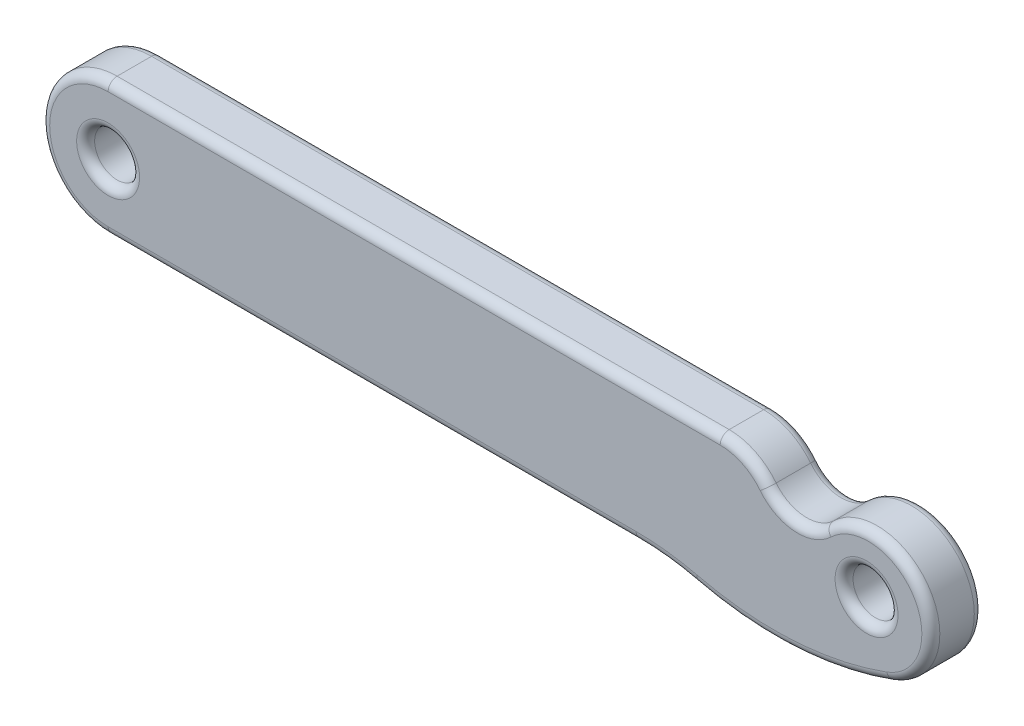
ISO-10303-21;
HEADER;
FILE_DESCRIPTION(('STEP AP214'),'2;1');
FILE_NAME('part.step','',(''),(''),'','','');
FILE_SCHEMA(('AUTOMOTIVE_DESIGN { 1 0 10303 214 1 1 1 1 }'));
ENDSEC;
DATA;
#1=APPLICATION_CONTEXT('core data for automotive mechanical design processes');
#2=APPLICATION_PROTOCOL_DEFINITION('international standard','automotive_design',2000,#1);
#3=PRODUCT_CONTEXT('',#1,'mechanical');
#4=PRODUCT('Part','Part','',(#3));
#5=PRODUCT_RELATED_PRODUCT_CATEGORY('part','',(#4));
#6=PRODUCT_DEFINITION_FORMATION('','',#4);
#7=PRODUCT_DEFINITION_CONTEXT('part definition',#1,'design');
#8=PRODUCT_DEFINITION('design','',#6,#7);
#9=PRODUCT_DEFINITION_SHAPE('','',#8);
#10=(LENGTH_UNIT() NAMED_UNIT(*) SI_UNIT(.MILLI.,.METRE.));
#11=(NAMED_UNIT(*) PLANE_ANGLE_UNIT() SI_UNIT($,.RADIAN.));
#12=(NAMED_UNIT(*) SI_UNIT($,.STERADIAN.) SOLID_ANGLE_UNIT());
#13=UNCERTAINTY_MEASURE_WITH_UNIT(LENGTH_MEASURE(1.E-05),#10,'distance_accuracy_value','');
#14=(GEOMETRIC_REPRESENTATION_CONTEXT(3) GLOBAL_UNCERTAINTY_ASSIGNED_CONTEXT((#13)) GLOBAL_UNIT_ASSIGNED_CONTEXT((#10,
#11,#12)) REPRESENTATION_CONTEXT('',''));
#15=CARTESIAN_POINT('',(0.,0.,0.));
#16=DIRECTION('',(0.,0.,1.));
#17=DIRECTION('',(1.,0.,0.));
#18=AXIS2_PLACEMENT_3D('',#15,#16,#17);
#19=CARTESIAN_POINT('',(0.,0.,1.75));
#20=DIRECTION('',(0.,0.,1.));
#21=DIRECTION('',(1.,0.,0.));
#22=AXIS2_PLACEMENT_3D('',#19,#20,#21);
#23=PLANE('',#22);
#24=CARTESIAN_POINT('',(25.3139123,0.,1.75));
#25=DIRECTION('',(0.,0.,1.));
#26=DIRECTION('',(1.,0.,0.));
#27=AXIS2_PLACEMENT_3D('',#24,#25,#26);
#28=CIRCLE('',#27,1.05);
#29=CARTESIAN_POINT('',(26.3639123,0.,1.75));
#30=VERTEX_POINT('',#29);
#31=EDGE_CURVE('E13',#30,#30,#28,.F.);
#32=ORIENTED_EDGE('',*,*,#31,.T.);
#33=EDGE_LOOP('',(#32));
#34=FACE_BOUND('',#33,.T.);
#35=CARTESIAN_POINT('',(0.,0.,1.75));
#36=DIRECTION('',(0.,0.,1.));
#37=DIRECTION('',(1.,0.,0.));
#38=AXIS2_PLACEMENT_3D('',#35,#36,#37);
#39=CIRCLE('',#38,1.05);
#40=CARTESIAN_POINT('',(1.05,0.,1.75));
#41=VERTEX_POINT('',#40);
#42=EDGE_CURVE('E55',#41,#41,#39,.F.);
#43=ORIENTED_EDGE('',*,*,#42,.T.);
#44=EDGE_LOOP('',(#43));
#45=FACE_BOUND('',#44,.T.);
#46=DIRECTION('',(-1.,0.,0.));
#47=VECTOR('',#46,1.);
#48=CARTESIAN_POINT('',(0.,1.95,1.75));
#49=LINE('',#48,#47);
#50=CARTESIAN_POINT('',(20.428705221818,1.95,1.75));
#51=VERTEX_POINT('',#50);
#52=CARTESIAN_POINT('',(0.,1.95,1.75));
#53=VERTEX_POINT('',#52);
#54=EDGE_CURVE('E63',#51,#53,#49,.T.);
#55=ORIENTED_EDGE('',*,*,#54,.T.);
#56=CARTESIAN_POINT('',(0.,0.,1.75));
#57=DIRECTION('',(0.,0.,1.));
#58=DIRECTION('',(1.,0.,0.));
#59=AXIS2_PLACEMENT_3D('',#56,#57,#58);
#60=CIRCLE('',#59,1.95);
#61=CARTESIAN_POINT('',(0.,-1.95,1.75));
#62=VERTEX_POINT('',#61);
#63=EDGE_CURVE('E254',#53,#62,#60,.T.);
#64=ORIENTED_EDGE('',*,*,#63,.T.);
#65=DIRECTION('',(1.,0.,0.));
#66=VECTOR('',#65,1.);
#67=CARTESIAN_POINT('',(17.6231832897015,-1.95,1.75));
#68=LINE('',#67,#66);
#69=CARTESIAN_POINT('',(17.6231832897015,-1.95,1.75));
#70=VERTEX_POINT('',#69);
#71=EDGE_CURVE('E242',#62,#70,#68,.T.);
#72=ORIENTED_EDGE('',*,*,#71,.T.);
#73=CARTESIAN_POINT('',(17.6231832897015,-10.658025818146,1.75));
#74=DIRECTION('',(0.,0.,1.));
#75=DIRECTION('',(1.,0.,0.));
#76=AXIS2_PLACEMENT_3D('',#73,#74,#75);
#77=CIRCLE('',#76,8.70802581814601);
#78=CARTESIAN_POINT('',(19.6652217516383,-2.19281509605124,1.75));
#79=VERTEX_POINT('',#78);
#80=EDGE_CURVE('E244',#70,#79,#77,.F.);
#81=ORIENTED_EDGE('',*,*,#80,.T.);
#82=CARTESIAN_POINT('',(22.2272317743348,8.42792252398077,1.75));
#83=DIRECTION('',(0.,0.,1.));
#84=DIRECTION('',(1.,0.,0.));
#85=AXIS2_PLACEMENT_3D('',#82,#83,#84);
#86=CIRCLE('',#85,10.9253815928763);
#87=CARTESIAN_POINT('',(25.9845274669165,-1.83105851842629,1.75));
#88=VERTEX_POINT('',#87);
#89=EDGE_CURVE('E246',#79,#88,#86,.T.);
#90=ORIENTED_EDGE('',*,*,#89,.T.);
#91=CARTESIAN_POINT('',(25.3684003786519,-0.148775132878208,1.75));
#92=DIRECTION('',(0.,0.,1.));
#93=DIRECTION('',(1.,0.,0.));
#94=AXIS2_PLACEMENT_3D('',#91,#92,#93);
#95=CIRCLE('',#94,1.79156076597604);
#96=CARTESIAN_POINT('',(24.1267235404538,1.14270797102491,1.75));
#97=VERTEX_POINT('',#96);
#98=EDGE_CURVE('E248',#88,#97,#95,.T.);
#99=ORIENTED_EDGE('',*,*,#98,.T.);
#100=CARTESIAN_POINT('',(23.0178117028837,2.29610059129665,1.75));
#101=DIRECTION('',(0.,0.,1.));
#102=DIRECTION('',(1.,0.,0.));
#103=AXIS2_PLACEMENT_3D('',#100,#101,#102);
#104=CIRCLE('',#103,1.60000000000013);
#105=CARTESIAN_POINT('',(21.7624873484276,1.30405181975884,1.75));
#106=VERTEX_POINT('',#105);
#107=EDGE_CURVE('E250',#97,#106,#104,.F.);
#108=ORIENTED_EDGE('',*,*,#107,.T.);
#109=CARTESIAN_POINT('',(20.428705221818,0.25,1.75));
#110=DIRECTION('',(0.,0.,1.));
#111=DIRECTION('',(1.,0.,0.));
#112=AXIS2_PLACEMENT_3D('',#109,#110,#111);
#113=CIRCLE('',#112,1.7);
#114=EDGE_CURVE('E68',#106,#51,#113,.T.);
#115=ORIENTED_EDGE('',*,*,#114,.T.);
#116=EDGE_LOOP('',(#55,#64,#72,#81,#90,#99,#108,#115));
#117=FACE_BOUND('',#116,.T.);
#118=ADVANCED_FACE('F46',(#34,#45,#117),#23,.T.);
#119=CARTESIAN_POINT('',(0.,0.,0.));
#120=DIRECTION('',(0.,0.,1.));
#121=DIRECTION('',(1.,0.,0.));
#122=AXIS2_PLACEMENT_3D('',#119,#120,#121);
#123=PLANE('',#122);
#124=CARTESIAN_POINT('',(25.3139123,0.,0.));
#125=DIRECTION('',(0.,0.,1.));
#126=DIRECTION('',(1.,0.,0.));
#127=AXIS2_PLACEMENT_3D('',#124,#125,#126);
#128=CIRCLE('',#127,1.05);
#129=CARTESIAN_POINT('',(26.3639123,0.,0.));
#130=VERTEX_POINT('',#129);
#131=EDGE_CURVE('E190',#130,#130,#128,.T.);
#132=ORIENTED_EDGE('',*,*,#131,.T.);
#133=EDGE_LOOP('',(#132));
#134=FACE_BOUND('',#133,.T.);
#135=CARTESIAN_POINT('',(0.,0.,0.));
#136=DIRECTION('',(0.,0.,1.));
#137=DIRECTION('',(1.,0.,0.));
#138=AXIS2_PLACEMENT_3D('',#135,#136,#137);
#139=CIRCLE('',#138,1.05);
#140=CARTESIAN_POINT('',(1.05,0.,0.));
#141=VERTEX_POINT('',#140);
#142=EDGE_CURVE('E187',#141,#141,#139,.T.);
#143=ORIENTED_EDGE('',*,*,#142,.T.);
#144=EDGE_LOOP('',(#143));
#145=FACE_BOUND('',#144,.T.);
#146=CARTESIAN_POINT('',(20.428705221818,0.25,0.));
#147=DIRECTION('',(0.,0.,1.));
#148=DIRECTION('',(1.,0.,0.));
#149=AXIS2_PLACEMENT_3D('',#146,#147,#148);
#150=CIRCLE('',#149,1.7);
#151=CARTESIAN_POINT('',(20.428705221818,1.95,0.));
#152=VERTEX_POINT('',#151);
#153=CARTESIAN_POINT('',(21.7624873484276,1.30405181975884,0.));
#154=VERTEX_POINT('',#153);
#155=EDGE_CURVE('E185',#152,#154,#150,.F.);
#156=ORIENTED_EDGE('',*,*,#155,.T.);
#157=CARTESIAN_POINT('',(23.0178117028837,2.29610059129665,0.));
#158=DIRECTION('',(0.,0.,1.));
#159=DIRECTION('',(1.,0.,0.));
#160=AXIS2_PLACEMENT_3D('',#157,#158,#159);
#161=CIRCLE('',#160,1.60000000000013);
#162=CARTESIAN_POINT('',(24.1267235404538,1.14270797102491,0.));
#163=VERTEX_POINT('',#162);
#164=EDGE_CURVE('E166',#154,#163,#161,.T.);
#165=ORIENTED_EDGE('',*,*,#164,.T.);
#166=CARTESIAN_POINT('',(25.3684003786519,-0.148775132878208,0.));
#167=DIRECTION('',(0.,0.,1.));
#168=DIRECTION('',(1.,0.,0.));
#169=AXIS2_PLACEMENT_3D('',#166,#167,#168);
#170=CIRCLE('',#169,1.79156076597604);
#171=CARTESIAN_POINT('',(25.9845274669165,-1.8310585184263,0.));
#172=VERTEX_POINT('',#171);
#173=EDGE_CURVE('E174',#163,#172,#170,.F.);
#174=ORIENTED_EDGE('',*,*,#173,.T.);
#175=CARTESIAN_POINT('',(22.2272317743348,8.42792252398077,0.));
#176=DIRECTION('',(0.,0.,1.));
#177=DIRECTION('',(1.,0.,0.));
#178=AXIS2_PLACEMENT_3D('',#175,#176,#177);
#179=CIRCLE('',#178,10.9253815928763);
#180=CARTESIAN_POINT('',(19.6652217516383,-2.19281509605124,0.));
#181=VERTEX_POINT('',#180);
#182=EDGE_CURVE('E180',#172,#181,#179,.F.);
#183=ORIENTED_EDGE('',*,*,#182,.T.);
#184=CARTESIAN_POINT('',(17.6231832897015,-10.658025818146,0.));
#185=DIRECTION('',(0.,0.,1.));
#186=DIRECTION('',(1.,0.,0.));
#187=AXIS2_PLACEMENT_3D('',#184,#185,#186);
#188=CIRCLE('',#187,8.70802581814601);
#189=CARTESIAN_POINT('',(17.6231832897015,-1.95,0.));
#190=VERTEX_POINT('',#189);
#191=EDGE_CURVE('E338',#181,#190,#188,.T.);
#192=ORIENTED_EDGE('',*,*,#191,.T.);
#193=DIRECTION('',(1.,0.,0.));
#194=VECTOR('',#193,1.);
#195=CARTESIAN_POINT('',(0.,-1.95,0.));
#196=LINE('',#195,#194);
#197=CARTESIAN_POINT('',(0.,-1.95,0.));
#198=VERTEX_POINT('',#197);
#199=EDGE_CURVE('E340',#190,#198,#196,.F.);
#200=ORIENTED_EDGE('',*,*,#199,.T.);
#201=CARTESIAN_POINT('',(0.,0.,0.));
#202=DIRECTION('',(0.,0.,1.));
#203=DIRECTION('',(1.,0.,0.));
#204=AXIS2_PLACEMENT_3D('',#201,#202,#203);
#205=CIRCLE('',#204,1.95);
#206=CARTESIAN_POINT('',(0.,1.95,0.));
#207=VERTEX_POINT('',#206);
#208=EDGE_CURVE('E342',#198,#207,#205,.F.);
#209=ORIENTED_EDGE('',*,*,#208,.T.);
#210=DIRECTION('',(-1.,0.,0.));
#211=VECTOR('',#210,1.);
#212=CARTESIAN_POINT('',(0.,1.95,0.));
#213=LINE('',#212,#211);
#214=EDGE_CURVE('E192',#207,#152,#213,.F.);
#215=ORIENTED_EDGE('',*,*,#214,.T.);
#216=EDGE_LOOP('',(#156,#165,#174,#183,#192,#200,#209,#215));
#217=FACE_BOUND('',#216,.T.);
#218=ADVANCED_FACE('F183',(#134,#145,#217),#123,.F.);
#219=CARTESIAN_POINT('',(0.,0.,1.75));
#220=DIRECTION('',(0.,0.,-1.));
#221=DIRECTION('',(-1.,0.,0.));
#222=AXIS2_PLACEMENT_3D('',#219,#220,#221);
#223=CYLINDRICAL_SURFACE('',#222,2.25);
#224=DIRECTION('',(0.,0.,-1.));
#225=VECTOR('',#224,1.);
#226=CARTESIAN_POINT('',(0.,2.25,1.75));
#227=LINE('',#226,#225);
#228=CARTESIAN_POINT('',(0.,2.25,1.45));
#229=VERTEX_POINT('',#228);
#230=CARTESIAN_POINT('',(0.,2.25,0.3));
#231=VERTEX_POINT('',#230);
#232=EDGE_CURVE('E320',#229,#231,#227,.T.);
#233=ORIENTED_EDGE('',*,*,#232,.T.);
#234=CARTESIAN_POINT('',(0.,0.,0.3));
#235=DIRECTION('',(0.,0.,1.));
#236=DIRECTION('',(1.,0.,0.));
#237=AXIS2_PLACEMENT_3D('',#234,#235,#236);
#238=CIRCLE('',#237,2.25);
#239=CARTESIAN_POINT('',(0.,-2.25,0.3));
#240=VERTEX_POINT('',#239);
#241=EDGE_CURVE('E224',#231,#240,#238,.T.);
#242=ORIENTED_EDGE('',*,*,#241,.T.);
#243=DIRECTION('',(0.,0.,-1.));
#244=VECTOR('',#243,1.);
#245=CARTESIAN_POINT('',(0.,-2.25,1.75));
#246=LINE('',#245,#244);
#247=CARTESIAN_POINT('',(0.,-2.25,1.45));
#248=VERTEX_POINT('',#247);
#249=EDGE_CURVE('E181',#248,#240,#246,.T.);
#250=ORIENTED_EDGE('',*,*,#249,.F.);
#251=CARTESIAN_POINT('',(0.,0.,1.45));
#252=DIRECTION('',(0.,0.,1.));
#253=DIRECTION('',(1.,0.,0.));
#254=AXIS2_PLACEMENT_3D('',#251,#252,#253);
#255=CIRCLE('',#254,2.25);
#256=EDGE_CURVE('E221',#248,#229,#255,.F.);
#257=ORIENTED_EDGE('',*,*,#256,.T.);
#258=EDGE_LOOP('',(#233,#242,#250,#257));
#259=FACE_BOUND('',#258,.T.);
#260=ADVANCED_FACE('F387',(#259),#223,.T.);
#261=CARTESIAN_POINT('',(0.,-2.25,1.75));
#262=DIRECTION('',(0.,1.,0.));
#263=DIRECTION('',(0.,0.,1.));
#264=AXIS2_PLACEMENT_3D('',#261,#262,#263);
#265=PLANE('',#264);
#266=ORIENTED_EDGE('',*,*,#249,.T.);
#267=DIRECTION('',(1.,0.,0.));
#268=VECTOR('',#267,1.);
#269=CARTESIAN_POINT('',(0.,-2.25,0.3));
#270=LINE('',#269,#268);
#271=CARTESIAN_POINT('',(17.6231832897015,-2.25,0.3));
#272=VERTEX_POINT('',#271);
#273=EDGE_CURVE('E228',#240,#272,#270,.T.);
#274=ORIENTED_EDGE('',*,*,#273,.T.);
#275=DIRECTION('',(0.,0.,1.));
#276=VECTOR('',#275,1.);
#277=CARTESIAN_POINT('',(17.6231832897015,-2.25,0.));
#278=LINE('',#277,#276);
#279=CARTESIAN_POINT('',(17.6231832897015,-2.25,1.45));
#280=VERTEX_POINT('',#279);
#281=EDGE_CURVE('E275',#272,#280,#278,.T.);
#282=ORIENTED_EDGE('',*,*,#281,.T.);
#283=DIRECTION('',(1.,0.,0.));
#284=VECTOR('',#283,1.);
#285=CARTESIAN_POINT('',(0.,-2.25,1.45));
#286=LINE('',#285,#284);
#287=EDGE_CURVE('E226',#280,#248,#286,.F.);
#288=ORIENTED_EDGE('',*,*,#287,.T.);
#289=EDGE_LOOP('',(#266,#274,#282,#288));
#290=FACE_BOUND('',#289,.T.);
#291=ADVANCED_FACE('F383',(#290),#265,.F.);
#292=CARTESIAN_POINT('',(0.,2.25,1.75));
#293=DIRECTION('',(0.,-1.,0.));
#294=DIRECTION('',(0.,0.,-1.));
#295=AXIS2_PLACEMENT_3D('',#292,#293,#294);
#296=PLANE('',#295);
#297=DIRECTION('',(0.,0.,1.));
#298=VECTOR('',#297,1.);
#299=CARTESIAN_POINT('',(20.428705221818,2.25,0.));
#300=LINE('',#299,#298);
#301=CARTESIAN_POINT('',(20.428705221818,2.25,0.3));
#302=VERTEX_POINT('',#301);
#303=CARTESIAN_POINT('',(20.428705221818,2.25,1.45));
#304=VERTEX_POINT('',#303);
#305=EDGE_CURVE('E331',#302,#304,#300,.T.);
#306=ORIENTED_EDGE('',*,*,#305,.F.);
#307=DIRECTION('',(-1.,0.,0.));
#308=VECTOR('',#307,1.);
#309=CARTESIAN_POINT('',(0.,2.25,0.3));
#310=LINE('',#309,#308);
#311=EDGE_CURVE('E219',#302,#231,#310,.T.);
#312=ORIENTED_EDGE('',*,*,#311,.T.);
#313=ORIENTED_EDGE('',*,*,#232,.F.);
#314=DIRECTION('',(-1.,0.,0.));
#315=VECTOR('',#314,1.);
#316=CARTESIAN_POINT('',(20.428705221818,2.25,1.45));
#317=LINE('',#316,#315);
#318=EDGE_CURVE('E217',#229,#304,#317,.F.);
#319=ORIENTED_EDGE('',*,*,#318,.T.);
#320=EDGE_LOOP('',(#306,#312,#313,#319));
#321=FACE_BOUND('',#320,.T.);
#322=ADVANCED_FACE('F422',(#321),#296,.F.);
#323=CARTESIAN_POINT('',(0.,0.,1.75));
#324=DIRECTION('',(0.,0.,-1.));
#325=DIRECTION('',(-1.,0.,0.));
#326=AXIS2_PLACEMENT_3D('',#323,#324,#325);
#327=CYLINDRICAL_SURFACE('',#326,0.75);
#328=CARTESIAN_POINT('',(0.,0.,0.3));
#329=DIRECTION('',(0.,0.,1.));
#330=DIRECTION('',(1.,0.,0.));
#331=AXIS2_PLACEMENT_3D('',#328,#329,#330);
#332=CIRCLE('',#331,0.75);
#333=CARTESIAN_POINT('',(0.75,0.,0.3));
#334=VERTEX_POINT('',#333);
#335=EDGE_CURVE('E207',#334,#334,#332,.F.);
#336=ORIENTED_EDGE('',*,*,#335,.T.);
#337=EDGE_LOOP('',(#336));
#338=FACE_BOUND('',#337,.T.);
#339=CARTESIAN_POINT('',(0.,0.,1.45));
#340=DIRECTION('',(0.,0.,1.));
#341=DIRECTION('',(1.,0.,0.));
#342=AXIS2_PLACEMENT_3D('',#339,#340,#341);
#343=CIRCLE('',#342,0.75);
#344=CARTESIAN_POINT('',(0.75,0.,1.45));
#345=VERTEX_POINT('',#344);
#346=EDGE_CURVE('E204',#345,#345,#343,.T.);
#347=ORIENTED_EDGE('',*,*,#346,.T.);
#348=EDGE_LOOP('',(#347));
#349=FACE_BOUND('',#348,.T.);
#350=ADVANCED_FACE('F419',(#338,#349),#327,.F.);
#351=CARTESIAN_POINT('',(25.3139123,0.,1.75));
#352=DIRECTION('',(0.,0.,-1.));
#353=DIRECTION('',(-1.,0.,0.));
#354=AXIS2_PLACEMENT_3D('',#351,#352,#353);
#355=CYLINDRICAL_SURFACE('',#354,0.750000000000002);
#356=CARTESIAN_POINT('',(25.3139123,0.,0.3));
#357=DIRECTION('',(0.,0.,1.));
#358=DIRECTION('',(1.,0.,0.));
#359=AXIS2_PLACEMENT_3D('',#356,#357,#358);
#360=CIRCLE('',#359,0.750000000000002);
#361=CARTESIAN_POINT('',(26.0639123,0.,0.3));
#362=VERTEX_POINT('',#361);
#363=EDGE_CURVE('E201',#362,#362,#360,.F.);
#364=ORIENTED_EDGE('',*,*,#363,.T.);
#365=EDGE_LOOP('',(#364));
#366=FACE_BOUND('',#365,.T.);
#367=CARTESIAN_POINT('',(25.3139123,0.,1.45));
#368=DIRECTION('',(0.,0.,1.));
#369=DIRECTION('',(1.,0.,0.));
#370=AXIS2_PLACEMENT_3D('',#367,#368,#369);
#371=CIRCLE('',#370,0.750000000000002);
#372=CARTESIAN_POINT('',(26.0639123,0.,1.45));
#373=VERTEX_POINT('',#372);
#374=EDGE_CURVE('E198',#373,#373,#371,.T.);
#375=ORIENTED_EDGE('',*,*,#374,.T.);
#376=EDGE_LOOP('',(#375));
#377=FACE_BOUND('',#376,.T.);
#378=ADVANCED_FACE('F629',(#366,#377),#355,.F.);
#379=CARTESIAN_POINT('',(25.3684003786519,-0.148775132878208,0.));
#380=DIRECTION('',(0.,0.,1.));
#381=DIRECTION('',(1.,0.,0.));
#382=AXIS2_PLACEMENT_3D('',#379,#380,#381);
#383=CYLINDRICAL_SURFACE('',#382,2.09156076597604);
#384=DIRECTION('',(0.,0.,1.));
#385=VECTOR('',#384,1.);
#386=CARTESIAN_POINT('',(26.0876990310576,-2.11275982895341,0.));
#387=LINE('',#386,#385);
#388=CARTESIAN_POINT('',(26.0876990310576,-2.11275982895341,0.3));
#389=VERTEX_POINT('',#388);
#390=CARTESIAN_POINT('',(26.0876990310576,-2.11275982895341,1.45));
#391=VERTEX_POINT('',#390);
#392=EDGE_CURVE('E312',#389,#391,#387,.T.);
#393=ORIENTED_EDGE('',*,*,#392,.F.);
#394=CARTESIAN_POINT('',(25.3684003786519,-0.148775132878208,0.3));
#395=DIRECTION('',(0.,0.,1.));
#396=DIRECTION('',(1.,0.,0.));
#397=AXIS2_PLACEMENT_3D('',#394,#395,#396);
#398=CIRCLE('',#397,2.09156076597604);
#399=CARTESIAN_POINT('',(23.9188025709095,1.35896908732585,0.3));
#400=VERTEX_POINT('',#399);
#401=EDGE_CURVE('E240',#389,#400,#398,.T.);
#402=ORIENTED_EDGE('',*,*,#401,.T.);
#403=DIRECTION('',(0.,0.,1.));
#404=VECTOR('',#403,1.);
#405=CARTESIAN_POINT('',(23.9188025709095,1.35896908732585,0.));
#406=LINE('',#405,#404);
#407=CARTESIAN_POINT('',(23.9188025709095,1.35896908732585,1.45));
#408=VERTEX_POINT('',#407);
#409=EDGE_CURVE('E314',#400,#408,#406,.T.);
#410=ORIENTED_EDGE('',*,*,#409,.T.);
#411=CARTESIAN_POINT('',(25.3684003786519,-0.148775132878208,1.45));
#412=DIRECTION('',(0.,0.,1.));
#413=DIRECTION('',(1.,0.,0.));
#414=AXIS2_PLACEMENT_3D('',#411,#412,#413);
#415=CIRCLE('',#414,2.09156076597604);
#416=EDGE_CURVE('E238',#408,#391,#415,.F.);
#417=ORIENTED_EDGE('',*,*,#416,.T.);
#418=EDGE_LOOP('',(#393,#402,#410,#417));
#419=FACE_BOUND('',#418,.T.);
#420=ADVANCED_FACE('F311',(#419),#383,.T.);
#421=CARTESIAN_POINT('',(20.428705221818,0.25,0.));
#422=DIRECTION('',(0.,0.,1.));
#423=DIRECTION('',(1.,0.,0.));
#424=AXIS2_PLACEMENT_3D('',#421,#422,#423);
#425=CYLINDRICAL_SURFACE('',#424,2.);
#426=DIRECTION('',(0.,0.,1.));
#427=VECTOR('',#426,1.);
#428=CARTESIAN_POINT('',(21.9978606648881,1.49006096442217,0.));
#429=LINE('',#428,#427);
#430=CARTESIAN_POINT('',(21.9978606648881,1.49006096442217,0.3));
#431=VERTEX_POINT('',#430);
#432=CARTESIAN_POINT('',(21.9978606648881,1.49006096442217,1.45));
#433=VERTEX_POINT('',#432);
#434=EDGE_CURVE('E324',#431,#433,#429,.T.);
#435=ORIENTED_EDGE('',*,*,#434,.F.);
#436=CARTESIAN_POINT('',(20.428705221818,0.25,0.3));
#437=DIRECTION('',(0.,0.,1.));
#438=DIRECTION('',(1.,0.,0.));
#439=AXIS2_PLACEMENT_3D('',#436,#437,#438);
#440=CIRCLE('',#439,2.);
#441=EDGE_CURVE('E215',#431,#302,#440,.T.);
#442=ORIENTED_EDGE('',*,*,#441,.T.);
#443=ORIENTED_EDGE('',*,*,#305,.T.);
#444=CARTESIAN_POINT('',(20.428705221818,0.25,1.45));
#445=DIRECTION('',(0.,0.,1.));
#446=DIRECTION('',(1.,0.,0.));
#447=AXIS2_PLACEMENT_3D('',#444,#445,#446);
#448=CIRCLE('',#447,2.);
#449=EDGE_CURVE('E213',#304,#433,#448,.F.);
#450=ORIENTED_EDGE('',*,*,#449,.T.);
#451=EDGE_LOOP('',(#435,#442,#443,#450));
#452=FACE_BOUND('',#451,.T.);
#453=ADVANCED_FACE('F358',(#452),#425,.T.);
#454=CARTESIAN_POINT('',(23.0178117028837,2.29610059129665,0.));
#455=DIRECTION('',(0.,0.,1.));
#456=DIRECTION('',(1.,0.,0.));
#457=AXIS2_PLACEMENT_3D('',#454,#455,#456);
#458=CYLINDRICAL_SURFACE('',#457,1.30000000000013);
#459=ORIENTED_EDGE('',*,*,#409,.F.);
#460=CARTESIAN_POINT('',(23.0178117028837,2.29610059129665,0.3));
#461=DIRECTION('',(0.,0.,1.));
#462=DIRECTION('',(1.,0.,0.));
#463=AXIS2_PLACEMENT_3D('',#460,#461,#462);
#464=CIRCLE('',#463,1.30000000000013);
#465=EDGE_CURVE('E168',#400,#431,#464,.F.);
#466=ORIENTED_EDGE('',*,*,#465,.T.);
#467=ORIENTED_EDGE('',*,*,#434,.T.);
#468=CARTESIAN_POINT('',(23.0178117028837,2.29610059129665,1.45));
#469=DIRECTION('',(0.,0.,1.));
#470=DIRECTION('',(1.,0.,0.));
#471=AXIS2_PLACEMENT_3D('',#468,#469,#470);
#472=CIRCLE('',#471,1.30000000000013);
#473=EDGE_CURVE('E210',#433,#408,#472,.T.);
#474=ORIENTED_EDGE('',*,*,#473,.T.);
#475=EDGE_LOOP('',(#459,#466,#467,#474));
#476=FACE_BOUND('',#475,.T.);
#477=ADVANCED_FACE('F357',(#476),#458,.F.);
#478=CARTESIAN_POINT('',(22.2272317743348,8.42792252398077,0.));
#479=DIRECTION('',(0.,0.,1.));
#480=DIRECTION('',(1.,0.,0.));
#481=AXIS2_PLACEMENT_3D('',#478,#479,#480);
#482=CYLINDRICAL_SURFACE('',#481,11.2253815928763);
#483=DIRECTION('',(0.,0.,1.));
#484=VECTOR('',#483,1.);
#485=CARTESIAN_POINT('',(19.5948715308909,-2.48444987868319,0.));
#486=LINE('',#485,#484);
#487=CARTESIAN_POINT('',(19.5948715308909,-2.48444987868319,0.3));
#488=VERTEX_POINT('',#487);
#489=CARTESIAN_POINT('',(19.5948715308909,-2.48444987868319,1.45));
#490=VERTEX_POINT('',#489);
#491=EDGE_CURVE('E333',#488,#490,#486,.T.);
#492=ORIENTED_EDGE('',*,*,#491,.F.);
#493=CARTESIAN_POINT('',(22.2272317743348,8.42792252398077,0.3));
#494=DIRECTION('',(0.,0.,1.));
#495=DIRECTION('',(1.,0.,0.));
#496=AXIS2_PLACEMENT_3D('',#493,#494,#495);
#497=CIRCLE('',#496,11.2253815928763);
#498=EDGE_CURVE('E236',#488,#389,#497,.T.);
#499=ORIENTED_EDGE('',*,*,#498,.T.);
#500=ORIENTED_EDGE('',*,*,#392,.T.);
#501=CARTESIAN_POINT('',(22.2272317743348,8.42792252398077,1.45));
#502=DIRECTION('',(0.,0.,1.));
#503=DIRECTION('',(1.,0.,0.));
#504=AXIS2_PLACEMENT_3D('',#501,#502,#503);
#505=CIRCLE('',#504,11.2253815928763);
#506=EDGE_CURVE('E234',#391,#490,#505,.F.);
#507=ORIENTED_EDGE('',*,*,#506,.T.);
#508=EDGE_LOOP('',(#492,#499,#500,#507));
#509=FACE_BOUND('',#508,.T.);
#510=ADVANCED_FACE('F317',(#509),#482,.T.);
#511=CARTESIAN_POINT('',(17.6231832897015,-10.658025818146,0.));
#512=DIRECTION('',(0.,0.,1.));
#513=DIRECTION('',(1.,0.,0.));
#514=AXIS2_PLACEMENT_3D('',#511,#512,#513);
#515=CYLINDRICAL_SURFACE('',#514,8.40802581814601);
#516=ORIENTED_EDGE('',*,*,#281,.F.);
#517=CARTESIAN_POINT('',(17.6231832897015,-10.658025818146,0.3));
#518=DIRECTION('',(0.,0.,1.));
#519=DIRECTION('',(1.,0.,0.));
#520=AXIS2_PLACEMENT_3D('',#517,#518,#519);
#521=CIRCLE('',#520,8.40802581814601);
#522=EDGE_CURVE('E232',#272,#488,#521,.F.);
#523=ORIENTED_EDGE('',*,*,#522,.T.);
#524=ORIENTED_EDGE('',*,*,#491,.T.);
#525=CARTESIAN_POINT('',(17.6231832897015,-10.658025818146,1.45));
#526=DIRECTION('',(0.,0.,1.));
#527=DIRECTION('',(1.,0.,0.));
#528=AXIS2_PLACEMENT_3D('',#525,#526,#527);
#529=CIRCLE('',#528,8.40802581814601);
#530=EDGE_CURVE('E230',#490,#280,#529,.T.);
#531=ORIENTED_EDGE('',*,*,#530,.T.);
#532=EDGE_LOOP('',(#516,#523,#524,#531));
#533=FACE_BOUND('',#532,.T.);
#534=ADVANCED_FACE('F399',(#533),#515,.F.);
#535=CARTESIAN_POINT('',(25.3139123,0.,0.3));
#536=DIRECTION('',(0.,0.,1.));
#537=DIRECTION('',(1.,0.,0.));
#538=AXIS2_PLACEMENT_3D('',#535,#536,#537);
#539=TOROIDAL_SURFACE('',#538,1.05,0.3);
#540=ORIENTED_EDGE('',*,*,#363,.F.);
#541=EDGE_LOOP('',(#540));
#542=FACE_BOUND('',#541,.T.);
#543=ORIENTED_EDGE('',*,*,#131,.F.);
#544=EDGE_LOOP('',(#543));
#545=FACE_BOUND('',#544,.T.);
#546=ADVANCED_FACE('F430',(#542,#545),#539,.T.);
#547=CARTESIAN_POINT('',(0.,0.,0.3));
#548=DIRECTION('',(0.,0.,1.));
#549=DIRECTION('',(1.,0.,0.));
#550=AXIS2_PLACEMENT_3D('',#547,#548,#549);
#551=TOROIDAL_SURFACE('',#550,1.05,0.3);
#552=ORIENTED_EDGE('',*,*,#335,.F.);
#553=EDGE_LOOP('',(#552));
#554=FACE_BOUND('',#553,.T.);
#555=ORIENTED_EDGE('',*,*,#142,.F.);
#556=EDGE_LOOP('',(#555));
#557=FACE_BOUND('',#556,.T.);
#558=ADVANCED_FACE('F433',(#554,#557),#551,.T.);
#559=CARTESIAN_POINT('',(0.,-1.95,0.3));
#560=DIRECTION('',(1.,0.,0.));
#561=DIRECTION('',(0.,0.,-1.));
#562=AXIS2_PLACEMENT_3D('',#559,#560,#561);
#563=CYLINDRICAL_SURFACE('',#562,0.3);
#564=CARTESIAN_POINT('',(17.6231832897015,-1.95,0.3));
#565=DIRECTION('',(1.,0.,0.));
#566=DIRECTION('',(0.,0.,-1.));
#567=AXIS2_PLACEMENT_3D('',#564,#565,#566);
#568=CIRCLE('',#567,0.3);
#569=EDGE_CURVE('E269',#272,#190,#568,.T.);
#570=ORIENTED_EDGE('',*,*,#569,.F.);
#571=ORIENTED_EDGE('',*,*,#273,.F.);
#572=CARTESIAN_POINT('',(0.,-1.95,0.3));
#573=DIRECTION('',(-1.,0.,0.));
#574=DIRECTION('',(0.,0.,1.));
#575=AXIS2_PLACEMENT_3D('',#572,#573,#574);
#576=CIRCLE('',#575,0.3);
#577=EDGE_CURVE('E272',#198,#240,#576,.T.);
#578=ORIENTED_EDGE('',*,*,#577,.F.);
#579=ORIENTED_EDGE('',*,*,#199,.F.);
#580=EDGE_LOOP('',(#570,#571,#578,#579));
#581=FACE_BOUND('',#580,.T.);
#582=ADVANCED_FACE('F396',(#581),#563,.T.);
#583=CARTESIAN_POINT('',(0.,0.,0.3));
#584=DIRECTION('',(0.,0.,1.));
#585=DIRECTION('',(1.,0.,0.));
#586=AXIS2_PLACEMENT_3D('',#583,#584,#585);
#587=TOROIDAL_SURFACE('',#586,1.95,0.3);
#588=ORIENTED_EDGE('',*,*,#577,.T.);
#589=ORIENTED_EDGE('',*,*,#241,.F.);
#590=CARTESIAN_POINT('',(0.,1.95,0.3));
#591=DIRECTION('',(1.,0.,0.));
#592=DIRECTION('',(0.,0.,-1.));
#593=AXIS2_PLACEMENT_3D('',#590,#591,#592);
#594=CIRCLE('',#593,0.3);
#595=EDGE_CURVE('E266',#207,#231,#594,.T.);
#596=ORIENTED_EDGE('',*,*,#595,.F.);
#597=ORIENTED_EDGE('',*,*,#208,.F.);
#598=EDGE_LOOP('',(#588,#589,#596,#597));
#599=FACE_BOUND('',#598,.T.);
#600=ADVANCED_FACE('F391',(#599),#587,.T.);
#601=CARTESIAN_POINT('',(17.6231832897015,-10.658025818146,0.3));
#602=DIRECTION('',(0.,0.,1.));
#603=DIRECTION('',(1.,0.,0.));
#604=AXIS2_PLACEMENT_3D('',#601,#602,#603);
#605=TOROIDAL_SURFACE('',#604,8.70802581814601,0.3);
#606=ORIENTED_EDGE('',*,*,#569,.T.);
#607=ORIENTED_EDGE('',*,*,#191,.F.);
#608=CARTESIAN_POINT('',(19.6652217516383,-2.19281509605124,0.3));
#609=DIRECTION('',(0.972115942106506,-0.234500735824817,0.));
#610=DIRECTION('',(0.234500735824817,0.972115942106506,0.));
#611=AXIS2_PLACEMENT_3D('',#608,#609,#610);
#612=CIRCLE('',#611,0.3);
#613=EDGE_CURVE('E263',#488,#181,#612,.T.);
#614=ORIENTED_EDGE('',*,*,#613,.F.);
#615=ORIENTED_EDGE('',*,*,#522,.F.);
#616=EDGE_LOOP('',(#606,#607,#614,#615));
#617=FACE_BOUND('',#616,.T.);
#618=ADVANCED_FACE('F451',(#617),#605,.T.);
#619=CARTESIAN_POINT('',(0.,1.95,0.3));
#620=DIRECTION('',(-1.,0.,0.));
#621=DIRECTION('',(0.,0.,1.));
#622=AXIS2_PLACEMENT_3D('',#619,#620,#621);
#623=CYLINDRICAL_SURFACE('',#622,0.3);
#624=ORIENTED_EDGE('',*,*,#595,.T.);
#625=ORIENTED_EDGE('',*,*,#311,.F.);
#626=CARTESIAN_POINT('',(20.428705221818,1.95,0.3));
#627=DIRECTION('',(1.,0.,0.));
#628=DIRECTION('',(0.,0.,-1.));
#629=AXIS2_PLACEMENT_3D('',#626,#627,#628);
#630=CIRCLE('',#629,0.3);
#631=EDGE_CURVE('E260',#152,#302,#630,.T.);
#632=ORIENTED_EDGE('',*,*,#631,.F.);
#633=ORIENTED_EDGE('',*,*,#214,.F.);
#634=EDGE_LOOP('',(#624,#625,#632,#633));
#635=FACE_BOUND('',#634,.T.);
#636=ADVANCED_FACE('F349',(#635),#623,.T.);
#637=CARTESIAN_POINT('',(22.2272317743348,8.42792252398077,0.3));
#638=DIRECTION('',(0.,0.,1.));
#639=DIRECTION('',(1.,0.,0.));
#640=AXIS2_PLACEMENT_3D('',#637,#638,#639);
#641=TOROIDAL_SURFACE('',#640,10.9253815928763,0.3);
#642=ORIENTED_EDGE('',*,*,#613,.T.);
#643=ORIENTED_EDGE('',*,*,#182,.F.);
#644=CARTESIAN_POINT('',(25.9845274669165,-1.83105851842629,0.3));
#645=DIRECTION('',(0.939004368423731,0.343905213803382,0.));
#646=DIRECTION('',(-0.343905213803382,0.939004368423731,0.));
#647=AXIS2_PLACEMENT_3D('',#644,#645,#646);
#648=CIRCLE('',#647,0.3);
#649=EDGE_CURVE('E177',#389,#172,#648,.T.);
#650=ORIENTED_EDGE('',*,*,#649,.F.);
#651=ORIENTED_EDGE('',*,*,#498,.F.);
#652=EDGE_LOOP('',(#642,#643,#650,#651));
#653=FACE_BOUND('',#652,.T.);
#654=ADVANCED_FACE('F445',(#653),#641,.T.);
#655=CARTESIAN_POINT('',(20.428705221818,0.25,0.3));
#656=DIRECTION('',(0.,0.,1.));
#657=DIRECTION('',(1.,0.,0.));
#658=AXIS2_PLACEMENT_3D('',#655,#656,#657);
#659=TOROIDAL_SURFACE('',#658,1.7,0.3);
#660=ORIENTED_EDGE('',*,*,#631,.T.);
#661=ORIENTED_EDGE('',*,*,#441,.F.);
#662=CARTESIAN_POINT('',(21.7624873484276,1.30405181975884,0.3));
#663=DIRECTION('',(0.620030482211083,-0.784577721535026,0.));
#664=DIRECTION('',(0.784577721535026,0.620030482211083,0.));
#665=AXIS2_PLACEMENT_3D('',#662,#663,#664);
#666=CIRCLE('',#665,0.3);
#667=EDGE_CURVE('E171',#154,#431,#666,.T.);
#668=ORIENTED_EDGE('',*,*,#667,.F.);
#669=ORIENTED_EDGE('',*,*,#155,.F.);
#670=EDGE_LOOP('',(#660,#661,#668,#669));
#671=FACE_BOUND('',#670,.T.);
#672=ADVANCED_FACE('F352',(#671),#659,.T.);
#673=CARTESIAN_POINT('',(25.3684003786519,-0.148775132878208,0.3));
#674=DIRECTION('',(0.,0.,1.));
#675=DIRECTION('',(1.,0.,0.));
#676=AXIS2_PLACEMENT_3D('',#673,#674,#675);
#677=TOROIDAL_SURFACE('',#676,1.79156076597604,0.3);
#678=ORIENTED_EDGE('',*,*,#649,.T.);
#679=ORIENTED_EDGE('',*,*,#173,.F.);
#680=CARTESIAN_POINT('',(24.1267235404538,1.14270797102491,0.3));
#681=DIRECTION('',(-0.720870387669783,-0.693069898481254,0.));
#682=DIRECTION('',(0.693069898481254,-0.720870387669783,0.));
#683=AXIS2_PLACEMENT_3D('',#680,#681,#682);
#684=CIRCLE('',#683,0.3);
#685=EDGE_CURVE('E162',#400,#163,#684,.T.);
#686=ORIENTED_EDGE('',*,*,#685,.F.);
#687=ORIENTED_EDGE('',*,*,#401,.F.);
#688=EDGE_LOOP('',(#678,#679,#686,#687));
#689=FACE_BOUND('',#688,.T.);
#690=ADVANCED_FACE('F175',(#689),#677,.T.);
#691=CARTESIAN_POINT('',(23.0178117028837,2.29610059129665,0.3));
#692=DIRECTION('',(0.,0.,1.));
#693=DIRECTION('',(1.,0.,0.));
#694=AXIS2_PLACEMENT_3D('',#691,#692,#693);
#695=TOROIDAL_SURFACE('',#694,1.60000000000013,0.3);
#696=ORIENTED_EDGE('',*,*,#667,.T.);
#697=ORIENTED_EDGE('',*,*,#465,.F.);
#698=ORIENTED_EDGE('',*,*,#685,.T.);
#699=ORIENTED_EDGE('',*,*,#164,.F.);
#700=EDGE_LOOP('',(#696,#697,#698,#699));
#701=FACE_BOUND('',#700,.T.);
#702=ADVANCED_FACE('F164',(#701),#695,.T.);
#703=CARTESIAN_POINT('',(25.3139123,0.,1.45));
#704=DIRECTION('',(0.,0.,1.));
#705=DIRECTION('',(1.,0.,0.));
#706=AXIS2_PLACEMENT_3D('',#703,#704,#705);
#707=TOROIDAL_SURFACE('',#706,1.05,0.3);
#708=ORIENTED_EDGE('',*,*,#31,.F.);
#709=EDGE_LOOP('',(#708));
#710=FACE_BOUND('',#709,.T.);
#711=ORIENTED_EDGE('',*,*,#374,.F.);
#712=EDGE_LOOP('',(#711));
#713=FACE_BOUND('',#712,.T.);
#714=ADVANCED_FACE('F440',(#710,#713),#707,.T.);
#715=CARTESIAN_POINT('',(0.,0.,1.45));
#716=DIRECTION('',(0.,0.,1.));
#717=DIRECTION('',(1.,0.,0.));
#718=AXIS2_PLACEMENT_3D('',#715,#716,#717);
#719=TOROIDAL_SURFACE('',#718,1.05,0.3);
#720=ORIENTED_EDGE('',*,*,#42,.F.);
#721=EDGE_LOOP('',(#720));
#722=FACE_BOUND('',#721,.T.);
#723=ORIENTED_EDGE('',*,*,#346,.F.);
#724=EDGE_LOOP('',(#723));
#725=FACE_BOUND('',#724,.T.);
#726=ADVANCED_FACE('F461',(#722,#725),#719,.T.);
#727=CARTESIAN_POINT('',(25.3684003786519,-0.148775132878208,1.45));
#728=DIRECTION('',(0.,0.,1.));
#729=DIRECTION('',(1.,0.,0.));
#730=AXIS2_PLACEMENT_3D('',#727,#728,#729);
#731=TOROIDAL_SURFACE('',#730,1.79156076597604,0.3);
#732=CARTESIAN_POINT('',(25.9845274669165,-1.83105851842629,1.45));
#733=DIRECTION('',(-0.93900436842374,-0.343905213803358,0.));
#734=DIRECTION('',(0.343905213803358,-0.93900436842374,0.));
#735=AXIS2_PLACEMENT_3D('',#732,#733,#734);
#736=CIRCLE('',#735,0.3);
#737=EDGE_CURVE('E291',#391,#88,#736,.T.);
#738=ORIENTED_EDGE('',*,*,#737,.F.);
#739=ORIENTED_EDGE('',*,*,#416,.F.);
#740=CARTESIAN_POINT('',(24.1267235404538,1.14270797102491,1.45));
#741=DIRECTION('',(-0.720870387669784,-0.693069898481254,0.));
#742=DIRECTION('',(0.693069898481254,-0.720870387669784,0.));
#743=AXIS2_PLACEMENT_3D('',#740,#741,#742);
#744=CIRCLE('',#743,0.3);
#745=EDGE_CURVE('E50',#97,#408,#744,.T.);
#746=ORIENTED_EDGE('',*,*,#745,.F.);
#747=ORIENTED_EDGE('',*,*,#98,.F.);
#748=EDGE_LOOP('',(#738,#739,#746,#747));
#749=FACE_BOUND('',#748,.T.);
#750=ADVANCED_FACE('F48',(#749),#731,.T.);
#751=CARTESIAN_POINT('',(23.0178117028837,2.29610059129665,1.45));
#752=DIRECTION('',(0.,0.,1.));
#753=DIRECTION('',(1.,0.,0.));
#754=AXIS2_PLACEMENT_3D('',#751,#752,#753);
#755=TOROIDAL_SURFACE('',#754,1.60000000000013,0.3);
#756=ORIENTED_EDGE('',*,*,#745,.T.);
#757=ORIENTED_EDGE('',*,*,#473,.F.);
#758=CARTESIAN_POINT('',(21.7624873484276,1.30405181975884,1.45));
#759=DIRECTION('',(-0.620030482211083,0.784577721535025,0.));
#760=DIRECTION('',(-0.784577721535025,-0.620030482211083,0.));
#761=AXIS2_PLACEMENT_3D('',#758,#759,#760);
#762=CIRCLE('',#761,0.3);
#763=EDGE_CURVE('E289',#106,#433,#762,.T.);
#764=ORIENTED_EDGE('',*,*,#763,.F.);
#765=ORIENTED_EDGE('',*,*,#107,.F.);
#766=EDGE_LOOP('',(#756,#757,#764,#765));
#767=FACE_BOUND('',#766,.T.);
#768=ADVANCED_FACE('F302',(#767),#755,.T.);
#769=CARTESIAN_POINT('',(22.2272317743348,8.42792252398077,1.45));
#770=DIRECTION('',(0.,0.,1.));
#771=DIRECTION('',(1.,0.,0.));
#772=AXIS2_PLACEMENT_3D('',#769,#770,#771);
#773=TOROIDAL_SURFACE('',#772,10.9253815928763,0.3);
#774=ORIENTED_EDGE('',*,*,#737,.T.);
#775=ORIENTED_EDGE('',*,*,#89,.F.);
#776=CARTESIAN_POINT('',(19.6652217516383,-2.19281509605124,1.45));
#777=DIRECTION('',(-0.972115942106503,0.234500735824828,0.));
#778=DIRECTION('',(-0.234500735824828,-0.972115942106503,0.));
#779=AXIS2_PLACEMENT_3D('',#776,#777,#778);
#780=CIRCLE('',#779,0.3);
#781=EDGE_CURVE('E286',#490,#79,#780,.T.);
#782=ORIENTED_EDGE('',*,*,#781,.F.);
#783=ORIENTED_EDGE('',*,*,#506,.F.);
#784=EDGE_LOOP('',(#774,#775,#782,#783));
#785=FACE_BOUND('',#784,.T.);
#786=ADVANCED_FACE('F401',(#785),#773,.T.);
#787=CARTESIAN_POINT('',(20.428705221818,0.25,1.45));
#788=DIRECTION('',(0.,0.,1.));
#789=DIRECTION('',(1.,0.,0.));
#790=AXIS2_PLACEMENT_3D('',#787,#788,#789);
#791=TOROIDAL_SURFACE('',#790,1.7,0.3);
#792=ORIENTED_EDGE('',*,*,#763,.T.);
#793=ORIENTED_EDGE('',*,*,#449,.F.);
#794=CARTESIAN_POINT('',(20.428705221818,1.95,1.45));
#795=DIRECTION('',(-1.,0.,0.));
#796=DIRECTION('',(0.,0.,1.));
#797=AXIS2_PLACEMENT_3D('',#794,#795,#796);
#798=CIRCLE('',#797,0.3);
#799=EDGE_CURVE('E283',#51,#304,#798,.T.);
#800=ORIENTED_EDGE('',*,*,#799,.F.);
#801=ORIENTED_EDGE('',*,*,#114,.F.);
#802=EDGE_LOOP('',(#792,#793,#800,#801));
#803=FACE_BOUND('',#802,.T.);
#804=ADVANCED_FACE('F361',(#803),#791,.T.);
#805=CARTESIAN_POINT('',(17.6231832897015,-10.658025818146,1.45));
#806=DIRECTION('',(0.,0.,1.));
#807=DIRECTION('',(1.,0.,0.));
#808=AXIS2_PLACEMENT_3D('',#805,#806,#807);
#809=TOROIDAL_SURFACE('',#808,8.70802581814601,0.3);
#810=ORIENTED_EDGE('',*,*,#781,.T.);
#811=ORIENTED_EDGE('',*,*,#80,.F.);
#812=CARTESIAN_POINT('',(17.6231832897015,-1.95,1.45));
#813=DIRECTION('',(-1.,0.,0.));
#814=DIRECTION('',(0.,0.,1.));
#815=AXIS2_PLACEMENT_3D('',#812,#813,#814);
#816=CIRCLE('',#815,0.3);
#817=EDGE_CURVE('E280',#280,#70,#816,.T.);
#818=ORIENTED_EDGE('',*,*,#817,.F.);
#819=ORIENTED_EDGE('',*,*,#530,.F.);
#820=EDGE_LOOP('',(#810,#811,#818,#819));
#821=FACE_BOUND('',#820,.T.);
#822=ADVANCED_FACE('F375',(#821),#809,.T.);
#823=CARTESIAN_POINT('',(0.,1.95,1.45));
#824=DIRECTION('',(1.,0.,0.));
#825=DIRECTION('',(0.,0.,-1.));
#826=AXIS2_PLACEMENT_3D('',#823,#824,#825);
#827=CYLINDRICAL_SURFACE('',#826,0.3);
#828=ORIENTED_EDGE('',*,*,#799,.T.);
#829=ORIENTED_EDGE('',*,*,#318,.F.);
#830=CARTESIAN_POINT('',(0.,1.95,1.45));
#831=DIRECTION('',(-1.,0.,0.));
#832=DIRECTION('',(0.,0.,1.));
#833=AXIS2_PLACEMENT_3D('',#830,#831,#832);
#834=CIRCLE('',#833,0.3);
#835=EDGE_CURVE('E278',#53,#229,#834,.T.);
#836=ORIENTED_EDGE('',*,*,#835,.F.);
#837=ORIENTED_EDGE('',*,*,#54,.F.);
#838=EDGE_LOOP('',(#828,#829,#836,#837));
#839=FACE_BOUND('',#838,.T.);
#840=ADVANCED_FACE('F364',(#839),#827,.T.);
#841=CARTESIAN_POINT('',(0.,-1.95,1.45));
#842=DIRECTION('',(-1.,0.,0.));
#843=DIRECTION('',(0.,0.,1.));
#844=AXIS2_PLACEMENT_3D('',#841,#842,#843);
#845=CYLINDRICAL_SURFACE('',#844,0.3);
#846=ORIENTED_EDGE('',*,*,#817,.T.);
#847=ORIENTED_EDGE('',*,*,#71,.F.);
#848=CARTESIAN_POINT('',(0.,-1.95,1.45));
#849=DIRECTION('',(-1.,0.,0.));
#850=DIRECTION('',(0.,0.,1.));
#851=AXIS2_PLACEMENT_3D('',#848,#849,#850);
#852=CIRCLE('',#851,0.3);
#853=EDGE_CURVE('E276',#248,#62,#852,.T.);
#854=ORIENTED_EDGE('',*,*,#853,.F.);
#855=ORIENTED_EDGE('',*,*,#287,.F.);
#856=EDGE_LOOP('',(#846,#847,#854,#855));
#857=FACE_BOUND('',#856,.T.);
#858=ADVANCED_FACE('F379',(#857),#845,.T.);
#859=CARTESIAN_POINT('',(0.,0.,1.45));
#860=DIRECTION('',(0.,0.,1.));
#861=DIRECTION('',(1.,0.,0.));
#862=AXIS2_PLACEMENT_3D('',#859,#860,#861);
#863=TOROIDAL_SURFACE('',#862,1.95,0.3);
#864=ORIENTED_EDGE('',*,*,#835,.T.);
#865=ORIENTED_EDGE('',*,*,#256,.F.);
#866=ORIENTED_EDGE('',*,*,#853,.T.);
#867=ORIENTED_EDGE('',*,*,#63,.F.);
#868=EDGE_LOOP('',(#864,#865,#866,#867));
#869=FACE_BOUND('',#868,.T.);
#870=ADVANCED_FACE('F368',(#869),#863,.T.);
#871=CLOSED_SHELL('',(#118,#218,#260,#291,#322,#350,#378,#420,#453,#477,#510,#534,#546,#558,
#582,#600,#618,#636,#654,#672,#690,#702,#714,#726,#750,#768,#786,#804,#822,#840,#858,#870));
#872=MANIFOLD_SOLID_BREP('B2',#871);
#873=ADVANCED_BREP_SHAPE_REPRESENTATION('',(#18,#872),#14);
#874=SHAPE_DEFINITION_REPRESENTATION(#9,#873);
ENDSEC;
END-ISO-10303-21;
